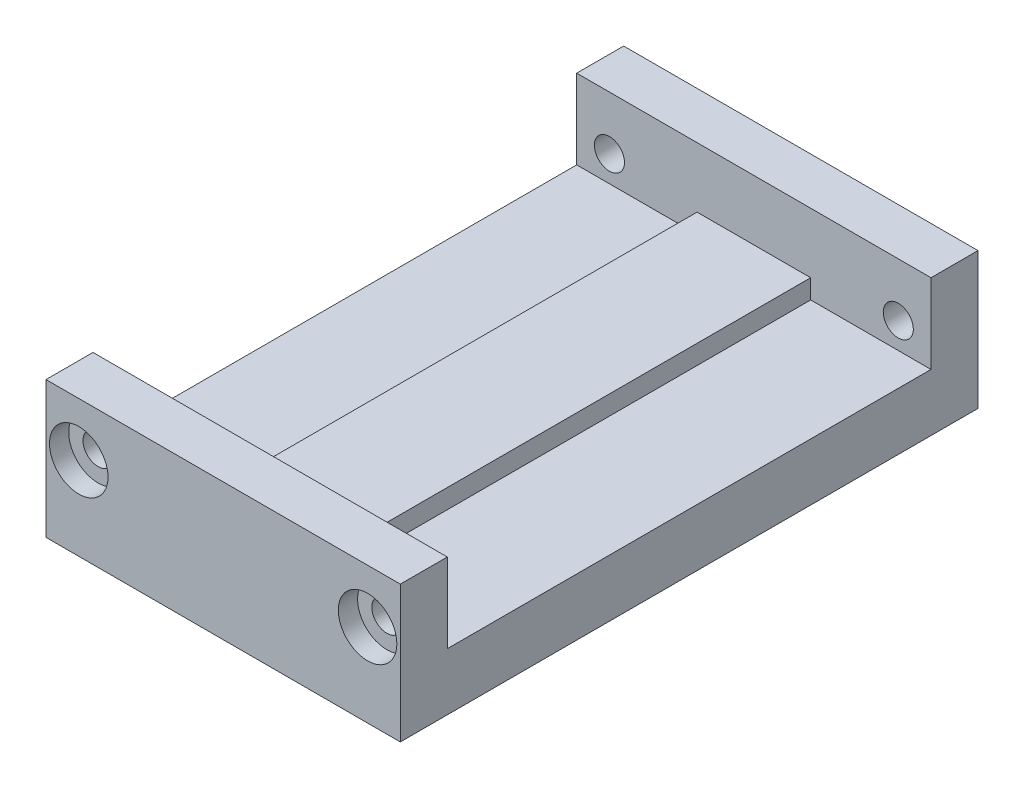
ISO-10303-21;
HEADER;
FILE_DESCRIPTION(('STEP AP214'),'2;1');
FILE_NAME('part.step','',(''),(''),'','','');
FILE_SCHEMA(('AUTOMOTIVE_DESIGN { 1 0 10303 214 1 1 1 1 }'));
ENDSEC;
DATA;
#1=APPLICATION_CONTEXT('core data for automotive mechanical design processes');
#2=APPLICATION_PROTOCOL_DEFINITION('international standard','automotive_design',2000,#1);
#3=PRODUCT_CONTEXT('',#1,'mechanical');
#4=PRODUCT('Part','Part','',(#3));
#5=PRODUCT_RELATED_PRODUCT_CATEGORY('part','',(#4));
#6=PRODUCT_DEFINITION_FORMATION('','',#4);
#7=PRODUCT_DEFINITION_CONTEXT('part definition',#1,'design');
#8=PRODUCT_DEFINITION('design','',#6,#7);
#9=PRODUCT_DEFINITION_SHAPE('','',#8);
#10=(LENGTH_UNIT() NAMED_UNIT(*) SI_UNIT(.MILLI.,.METRE.));
#11=(NAMED_UNIT(*) PLANE_ANGLE_UNIT() SI_UNIT($,.RADIAN.));
#12=(NAMED_UNIT(*) SI_UNIT($,.STERADIAN.) SOLID_ANGLE_UNIT());
#13=UNCERTAINTY_MEASURE_WITH_UNIT(LENGTH_MEASURE(1.E-05),#10,'distance_accuracy_value','');
#14=(GEOMETRIC_REPRESENTATION_CONTEXT(3) GLOBAL_UNCERTAINTY_ASSIGNED_CONTEXT((#13)) GLOBAL_UNIT_ASSIGNED_CONTEXT((#10,
#11,#12)) REPRESENTATION_CONTEXT('',''));
#15=CARTESIAN_POINT('',(0.,0.,0.));
#16=DIRECTION('',(0.,0.,1.));
#17=DIRECTION('',(1.,0.,0.));
#18=AXIS2_PLACEMENT_3D('',#15,#16,#17);
#19=CARTESIAN_POINT('',(9.525,5.4864,19.05));
#20=DIRECTION('',(0.,0.,-1.));
#21=DIRECTION('',(-1.,0.,0.));
#22=AXIS2_PLACEMENT_3D('',#19,#20,#21);
#23=CYLINDRICAL_SURFACE('',#22,0.992187499999999);
#24=CARTESIAN_POINT('',(9.525,5.4864,-15.9512));
#25=DIRECTION('',(0.,0.,-1.));
#26=DIRECTION('',(-1.,0.,0.));
#27=AXIS2_PLACEMENT_3D('',#24,#25,#26);
#28=CIRCLE('',#27,0.992187499999999);
#29=CARTESIAN_POINT('',(8.5328125,5.4864,-15.9512));
#30=VERTEX_POINT('',#29);
#31=EDGE_CURVE('E11',#30,#30,#28,.T.);
#32=CARTESIAN_POINT('',(9.525,5.4864,-17.78));
#33=DIRECTION('',(0.,0.,-1.));
#34=DIRECTION('',(-1.,0.,0.));
#35=AXIS2_PLACEMENT_3D('',#32,#33,#34);
#36=CIRCLE('',#35,0.992187499999999);
#37=CARTESIAN_POINT('',(8.5328125,5.4864,-17.78));
#38=VERTEX_POINT('',#37);
#39=EDGE_CURVE('E365',#38,#38,#36,.T.);
#40=CARTESIAN_POINT('',(8.5328125,5.4864,-15.9512));
#41=CARTESIAN_POINT('',(8.5328125,5.4864,-15.97025));
#42=CARTESIAN_POINT('',(8.5328125,5.4864,-15.9893));
#43=CARTESIAN_POINT('',(8.5328125,5.4864,-16.0274));
#44=CARTESIAN_POINT('',(8.5328125,5.4864,-16.04645));
#45=CARTESIAN_POINT('',(8.5328125,5.4864,-16.08455));
#46=CARTESIAN_POINT('',(8.5328125,5.4864,-16.1036));
#47=CARTESIAN_POINT('',(8.5328125,5.4864,-16.1417));
#48=CARTESIAN_POINT('',(8.5328125,5.4864,-16.16075));
#49=CARTESIAN_POINT('',(8.5328125,5.4864,-16.19885));
#50=CARTESIAN_POINT('',(8.5328125,5.4864,-16.2179));
#51=CARTESIAN_POINT('',(8.5328125,5.4864,-16.256));
#52=CARTESIAN_POINT('',(8.5328125,5.4864,-16.27505));
#53=CARTESIAN_POINT('',(8.5328125,5.4864,-16.31315));
#54=CARTESIAN_POINT('',(8.5328125,5.4864,-16.3322));
#55=CARTESIAN_POINT('',(8.5328125,5.4864,-16.3703));
#56=CARTESIAN_POINT('',(8.5328125,5.4864,-16.38935));
#57=CARTESIAN_POINT('',(8.5328125,5.4864,-16.42745));
#58=CARTESIAN_POINT('',(8.5328125,5.4864,-16.4465));
#59=CARTESIAN_POINT('',(8.5328125,5.4864,-16.4846));
#60=CARTESIAN_POINT('',(8.5328125,5.4864,-16.50365));
#61=CARTESIAN_POINT('',(8.5328125,5.4864,-16.54175));
#62=CARTESIAN_POINT('',(8.5328125,5.4864,-16.5608));
#63=CARTESIAN_POINT('',(8.5328125,5.4864,-16.5989));
#64=CARTESIAN_POINT('',(8.5328125,5.4864,-16.61795));
#65=CARTESIAN_POINT('',(8.5328125,5.4864,-16.65605));
#66=CARTESIAN_POINT('',(8.5328125,5.4864,-16.6751));
#67=CARTESIAN_POINT('',(8.5328125,5.4864,-16.7132));
#68=CARTESIAN_POINT('',(8.5328125,5.4864,-16.73225));
#69=CARTESIAN_POINT('',(8.5328125,5.4864,-16.77035));
#70=CARTESIAN_POINT('',(8.5328125,5.4864,-16.7894));
#71=CARTESIAN_POINT('',(8.5328125,5.4864,-16.8275));
#72=CARTESIAN_POINT('',(8.5328125,5.4864,-16.84655));
#73=CARTESIAN_POINT('',(8.5328125,5.4864,-16.88465));
#74=CARTESIAN_POINT('',(8.5328125,5.4864,-16.9037));
#75=CARTESIAN_POINT('',(8.5328125,5.4864,-16.9418));
#76=CARTESIAN_POINT('',(8.5328125,5.4864,-16.96085));
#77=CARTESIAN_POINT('',(8.5328125,5.4864,-16.99895));
#78=CARTESIAN_POINT('',(8.5328125,5.4864,-17.018));
#79=CARTESIAN_POINT('',(8.5328125,5.4864,-17.0561));
#80=CARTESIAN_POINT('',(8.5328125,5.4864,-17.07515));
#81=CARTESIAN_POINT('',(8.5328125,5.4864,-17.11325));
#82=CARTESIAN_POINT('',(8.5328125,5.4864,-17.1323));
#83=CARTESIAN_POINT('',(8.5328125,5.4864,-17.1704));
#84=CARTESIAN_POINT('',(8.5328125,5.4864,-17.18945));
#85=CARTESIAN_POINT('',(8.5328125,5.4864,-17.22755));
#86=CARTESIAN_POINT('',(8.5328125,5.4864,-17.2466));
#87=CARTESIAN_POINT('',(8.5328125,5.4864,-17.2847));
#88=CARTESIAN_POINT('',(8.5328125,5.4864,-17.30375));
#89=CARTESIAN_POINT('',(8.5328125,5.4864,-17.34185));
#90=CARTESIAN_POINT('',(8.5328125,5.4864,-17.3609));
#91=CARTESIAN_POINT('',(8.5328125,5.4864,-17.399));
#92=CARTESIAN_POINT('',(8.5328125,5.4864,-17.41805));
#93=CARTESIAN_POINT('',(8.5328125,5.4864,-17.45615));
#94=CARTESIAN_POINT('',(8.5328125,5.4864,-17.4752));
#95=CARTESIAN_POINT('',(8.5328125,5.4864,-17.5133));
#96=CARTESIAN_POINT('',(8.5328125,5.4864,-17.53235));
#97=CARTESIAN_POINT('',(8.5328125,5.4864,-17.57045));
#98=CARTESIAN_POINT('',(8.5328125,5.4864,-17.5895));
#99=CARTESIAN_POINT('',(8.5328125,5.4864,-17.6276));
#100=CARTESIAN_POINT('',(8.5328125,5.4864,-17.64665));
#101=CARTESIAN_POINT('',(8.5328125,5.4864,-17.68475));
#102=CARTESIAN_POINT('',(8.5328125,5.4864,-17.7038));
#103=CARTESIAN_POINT('',(8.5328125,5.4864,-17.7419));
#104=CARTESIAN_POINT('',(8.5328125,5.4864,-17.76095));
#105=CARTESIAN_POINT('',(8.5328125,5.4864,-17.78));
#106=B_SPLINE_CURVE_WITH_KNOTS('',3,(#40,#41,#42,#43,#44,#45,#46,#47,#48,#49,#50,#51,#52,#53,
#54,#55,#56,#57,#58,#59,#60,#61,#62,#63,#64,#65,#66,#67,#68,#69,#70,#71,#72,#73,#74,#75,#76,#77,
#78,#79,#80,#81,#82,#83,#84,#85,#86,#87,#88,#89,#90,#91,#92,#93,#94,#95,#96,#97,#98,#99,#100,
#101,#102,#103,#104,#105),.UNSPECIFIED.,.F.,.F.,(4,2,2,2,2,2,2,2,2,2,2,2,2,2,2,2,2,2,2,2,2,2,2,
2,2,2,2,2,2,2,2,2,4),(0.,0.0571499999999989,0.114299999999998,0.171449999999997,
0.228599999999995,0.285750000000001,0.3429,0.400049999999999,0.457199999999998,
0.514349999999997,0.571499999999996,0.628649999999994,0.6858,0.742949999999999,
0.800099999999998,0.857249999999997,0.914399999999996,0.971549999999995,1.02869999999999,
1.08584999999999,1.14299999999999,1.20015,1.2573,1.31444999999999,1.37159999999999,
1.42874999999999,1.48589999999999,1.54304999999999,1.6002,1.65734999999999,1.71449999999999,
1.77164999999999,1.82879999999999),.UNSPECIFIED.);
#107=EDGE_CURVE('BSEAM361',#30,#38,#106,.T.);
#108=ORIENTED_EDGE('',*,*,#31,.F.);
#109=ORIENTED_EDGE('',*,*,#39,.T.);
#110=ORIENTED_EDGE('',*,*,#107,.T.);
#111=ORIENTED_EDGE('',*,*,#107,.F.);
#112=EDGE_LOOP('',(#108,#110,#109,#111));
#113=FACE_BOUND('',#112,.T.);
#114=ADVANCED_FACE('F361',(#113),#23,.F.);
#115=CARTESIAN_POINT('',(-9.525,5.4864,19.05));
#116=DIRECTION('',(0.,0.,-1.));
#117=DIRECTION('',(-1.,0.,0.));
#118=AXIS2_PLACEMENT_3D('',#115,#116,#117);
#119=CYLINDRICAL_SURFACE('',#118,0.992187499999999);
#120=CARTESIAN_POINT('',(-9.525,5.4864,-15.9512));
#121=DIRECTION('',(0.,0.,-1.));
#122=DIRECTION('',(-1.,0.,0.));
#123=AXIS2_PLACEMENT_3D('',#120,#121,#122);
#124=CIRCLE('',#123,0.992187499999999);
#125=CARTESIAN_POINT('',(-10.5171875,5.4864,-15.9512));
#126=VERTEX_POINT('',#125);
#127=EDGE_CURVE('E497',#126,#126,#124,.T.);
#128=CARTESIAN_POINT('',(-9.525,5.4864,-17.78));
#129=DIRECTION('',(0.,0.,-1.));
#130=DIRECTION('',(-1.,0.,0.));
#131=AXIS2_PLACEMENT_3D('',#128,#129,#130);
#132=CIRCLE('',#131,0.992187499999999);
#133=CARTESIAN_POINT('',(-10.5171875,5.4864,-17.78));
#134=VERTEX_POINT('',#133);
#135=EDGE_CURVE('E540',#134,#134,#132,.T.);
#136=CARTESIAN_POINT('',(-10.5171875,5.4864,-15.9512));
#137=CARTESIAN_POINT('',(-10.5171875,5.4864,-15.97025));
#138=CARTESIAN_POINT('',(-10.5171875,5.4864,-15.9893));
#139=CARTESIAN_POINT('',(-10.5171875,5.4864,-16.0274));
#140=CARTESIAN_POINT('',(-10.5171875,5.4864,-16.04645));
#141=CARTESIAN_POINT('',(-10.5171875,5.4864,-16.08455));
#142=CARTESIAN_POINT('',(-10.5171875,5.4864,-16.1036));
#143=CARTESIAN_POINT('',(-10.5171875,5.4864,-16.1417));
#144=CARTESIAN_POINT('',(-10.5171875,5.4864,-16.16075));
#145=CARTESIAN_POINT('',(-10.5171875,5.4864,-16.19885));
#146=CARTESIAN_POINT('',(-10.5171875,5.4864,-16.2179));
#147=CARTESIAN_POINT('',(-10.5171875,5.4864,-16.256));
#148=CARTESIAN_POINT('',(-10.5171875,5.4864,-16.27505));
#149=CARTESIAN_POINT('',(-10.5171875,5.4864,-16.31315));
#150=CARTESIAN_POINT('',(-10.5171875,5.4864,-16.3322));
#151=CARTESIAN_POINT('',(-10.5171875,5.4864,-16.3703));
#152=CARTESIAN_POINT('',(-10.5171875,5.4864,-16.38935));
#153=CARTESIAN_POINT('',(-10.5171875,5.4864,-16.42745));
#154=CARTESIAN_POINT('',(-10.5171875,5.4864,-16.4465));
#155=CARTESIAN_POINT('',(-10.5171875,5.4864,-16.4846));
#156=CARTESIAN_POINT('',(-10.5171875,5.4864,-16.50365));
#157=CARTESIAN_POINT('',(-10.5171875,5.4864,-16.54175));
#158=CARTESIAN_POINT('',(-10.5171875,5.4864,-16.5608));
#159=CARTESIAN_POINT('',(-10.5171875,5.4864,-16.5989));
#160=CARTESIAN_POINT('',(-10.5171875,5.4864,-16.61795));
#161=CARTESIAN_POINT('',(-10.5171875,5.4864,-16.65605));
#162=CARTESIAN_POINT('',(-10.5171875,5.4864,-16.6751));
#163=CARTESIAN_POINT('',(-10.5171875,5.4864,-16.7132));
#164=CARTESIAN_POINT('',(-10.5171875,5.4864,-16.73225));
#165=CARTESIAN_POINT('',(-10.5171875,5.4864,-16.77035));
#166=CARTESIAN_POINT('',(-10.5171875,5.4864,-16.7894));
#167=CARTESIAN_POINT('',(-10.5171875,5.4864,-16.8275));
#168=CARTESIAN_POINT('',(-10.5171875,5.4864,-16.84655));
#169=CARTESIAN_POINT('',(-10.5171875,5.4864,-16.88465));
#170=CARTESIAN_POINT('',(-10.5171875,5.4864,-16.9037));
#171=CARTESIAN_POINT('',(-10.5171875,5.4864,-16.9418));
#172=CARTESIAN_POINT('',(-10.5171875,5.4864,-16.96085));
#173=CARTESIAN_POINT('',(-10.5171875,5.4864,-16.99895));
#174=CARTESIAN_POINT('',(-10.5171875,5.4864,-17.018));
#175=CARTESIAN_POINT('',(-10.5171875,5.4864,-17.0561));
#176=CARTESIAN_POINT('',(-10.5171875,5.4864,-17.07515));
#177=CARTESIAN_POINT('',(-10.5171875,5.4864,-17.11325));
#178=CARTESIAN_POINT('',(-10.5171875,5.4864,-17.1323));
#179=CARTESIAN_POINT('',(-10.5171875,5.4864,-17.1704));
#180=CARTESIAN_POINT('',(-10.5171875,5.4864,-17.18945));
#181=CARTESIAN_POINT('',(-10.5171875,5.4864,-17.22755));
#182=CARTESIAN_POINT('',(-10.5171875,5.4864,-17.2466));
#183=CARTESIAN_POINT('',(-10.5171875,5.4864,-17.2847));
#184=CARTESIAN_POINT('',(-10.5171875,5.4864,-17.30375));
#185=CARTESIAN_POINT('',(-10.5171875,5.4864,-17.34185));
#186=CARTESIAN_POINT('',(-10.5171875,5.4864,-17.3609));
#187=CARTESIAN_POINT('',(-10.5171875,5.4864,-17.399));
#188=CARTESIAN_POINT('',(-10.5171875,5.4864,-17.41805));
#189=CARTESIAN_POINT('',(-10.5171875,5.4864,-17.45615));
#190=CARTESIAN_POINT('',(-10.5171875,5.4864,-17.4752));
#191=CARTESIAN_POINT('',(-10.5171875,5.4864,-17.5133));
#192=CARTESIAN_POINT('',(-10.5171875,5.4864,-17.53235));
#193=CARTESIAN_POINT('',(-10.5171875,5.4864,-17.57045));
#194=CARTESIAN_POINT('',(-10.5171875,5.4864,-17.5895));
#195=CARTESIAN_POINT('',(-10.5171875,5.4864,-17.6276));
#196=CARTESIAN_POINT('',(-10.5171875,5.4864,-17.64665));
#197=CARTESIAN_POINT('',(-10.5171875,5.4864,-17.68475));
#198=CARTESIAN_POINT('',(-10.5171875,5.4864,-17.7038));
#199=CARTESIAN_POINT('',(-10.5171875,5.4864,-17.7419));
#200=CARTESIAN_POINT('',(-10.5171875,5.4864,-17.76095));
#201=CARTESIAN_POINT('',(-10.5171875,5.4864,-17.78));
#202=B_SPLINE_CURVE_WITH_KNOTS('',3,(#136,#137,#138,#139,#140,#141,#142,#143,#144,#145,#146,
#147,#148,#149,#150,#151,#152,#153,#154,#155,#156,#157,#158,#159,#160,#161,#162,#163,#164,#165,
#166,#167,#168,#169,#170,#171,#172,#173,#174,#175,#176,#177,#178,#179,#180,#181,#182,#183,#184,
#185,#186,#187,#188,#189,#190,#191,#192,#193,#194,#195,#196,#197,#198,#199,#200,#201),
.UNSPECIFIED.,.F.,.F.,(4,2,2,2,2,2,2,2,2,2,2,2,2,2,2,2,2,2,2,2,2,2,2,2,2,2,2,2,2,2,2,2,4),(0.,
0.0571499999999989,0.114299999999998,0.171449999999997,0.228599999999995,0.285750000000001,
0.3429,0.400049999999999,0.457199999999998,0.514349999999997,0.571499999999996,
0.628649999999994,0.6858,0.742949999999999,0.800099999999998,0.857249999999997,
0.914399999999996,0.971549999999995,1.02869999999999,1.08584999999999,1.14299999999999,1.20015,
1.2573,1.31444999999999,1.37159999999999,1.42874999999999,1.48589999999999,1.54304999999999,
1.6002,1.65734999999999,1.71449999999999,1.77164999999999,1.82879999999999),.UNSPECIFIED.);
#203=EDGE_CURVE('BSEAM626',#126,#134,#202,.T.);
#204=ORIENTED_EDGE('',*,*,#127,.F.);
#205=ORIENTED_EDGE('',*,*,#135,.T.);
#206=ORIENTED_EDGE('',*,*,#203,.T.);
#207=ORIENTED_EDGE('',*,*,#203,.F.);
#208=EDGE_LOOP('',(#204,#206,#205,#207));
#209=FACE_BOUND('',#208,.T.);
#210=ADVANCED_FACE('F626',(#209),#119,.F.);
#211=CARTESIAN_POINT('',(9.525,5.4864,15.9512));
#212=DIRECTION('',(0.,0.,1.));
#213=DIRECTION('',(1.,0.,0.));
#214=AXIS2_PLACEMENT_3D('',#211,#212,#213);
#215=CIRCLE('',#214,0.992187499999999);
#216=CARTESIAN_POINT('',(8.5328125,5.4864,15.9512));
#217=VERTEX_POINT('',#216);
#218=EDGE_CURVE('E370',#217,#217,#215,.T.);
#219=CARTESIAN_POINT('',(9.525,5.4864,17.78));
#220=DIRECTION('',(0.,0.,1.));
#221=DIRECTION('',(1.,0.,0.));
#222=AXIS2_PLACEMENT_3D('',#219,#220,#221);
#223=CIRCLE('',#222,0.992187499999999);
#224=CARTESIAN_POINT('',(8.5328125,5.4864,17.78));
#225=VERTEX_POINT('',#224);
#226=EDGE_CURVE('E536',#225,#225,#223,.T.);
#227=CARTESIAN_POINT('',(8.5328125,5.4864,15.9512));
#228=CARTESIAN_POINT('',(8.5328125,5.4864,15.97025));
#229=CARTESIAN_POINT('',(8.5328125,5.4864,15.9893));
#230=CARTESIAN_POINT('',(8.5328125,5.4864,16.0274));
#231=CARTESIAN_POINT('',(8.5328125,5.4864,16.04645));
#232=CARTESIAN_POINT('',(8.5328125,5.4864,16.08455));
#233=CARTESIAN_POINT('',(8.5328125,5.4864,16.1036));
#234=CARTESIAN_POINT('',(8.5328125,5.4864,16.1417));
#235=CARTESIAN_POINT('',(8.5328125,5.4864,16.16075));
#236=CARTESIAN_POINT('',(8.5328125,5.4864,16.19885));
#237=CARTESIAN_POINT('',(8.5328125,5.4864,16.2179));
#238=CARTESIAN_POINT('',(8.5328125,5.4864,16.256));
#239=CARTESIAN_POINT('',(8.5328125,5.4864,16.27505));
#240=CARTESIAN_POINT('',(8.5328125,5.4864,16.31315));
#241=CARTESIAN_POINT('',(8.5328125,5.4864,16.3322));
#242=CARTESIAN_POINT('',(8.5328125,5.4864,16.3703));
#243=CARTESIAN_POINT('',(8.5328125,5.4864,16.38935));
#244=CARTESIAN_POINT('',(8.5328125,5.4864,16.42745));
#245=CARTESIAN_POINT('',(8.5328125,5.4864,16.4465));
#246=CARTESIAN_POINT('',(8.5328125,5.4864,16.4846));
#247=CARTESIAN_POINT('',(8.5328125,5.4864,16.50365));
#248=CARTESIAN_POINT('',(8.5328125,5.4864,16.54175));
#249=CARTESIAN_POINT('',(8.5328125,5.4864,16.5608));
#250=CARTESIAN_POINT('',(8.5328125,5.4864,16.5989));
#251=CARTESIAN_POINT('',(8.5328125,5.4864,16.61795));
#252=CARTESIAN_POINT('',(8.5328125,5.4864,16.65605));
#253=CARTESIAN_POINT('',(8.5328125,5.4864,16.6751));
#254=CARTESIAN_POINT('',(8.5328125,5.4864,16.7132));
#255=CARTESIAN_POINT('',(8.5328125,5.4864,16.73225));
#256=CARTESIAN_POINT('',(8.5328125,5.4864,16.77035));
#257=CARTESIAN_POINT('',(8.5328125,5.4864,16.7894));
#258=CARTESIAN_POINT('',(8.5328125,5.4864,16.8275));
#259=CARTESIAN_POINT('',(8.5328125,5.4864,16.84655));
#260=CARTESIAN_POINT('',(8.5328125,5.4864,16.88465));
#261=CARTESIAN_POINT('',(8.5328125,5.4864,16.9037));
#262=CARTESIAN_POINT('',(8.5328125,5.4864,16.9418));
#263=CARTESIAN_POINT('',(8.5328125,5.4864,16.96085));
#264=CARTESIAN_POINT('',(8.5328125,5.4864,16.99895));
#265=CARTESIAN_POINT('',(8.5328125,5.4864,17.018));
#266=CARTESIAN_POINT('',(8.5328125,5.4864,17.0561));
#267=CARTESIAN_POINT('',(8.5328125,5.4864,17.07515));
#268=CARTESIAN_POINT('',(8.5328125,5.4864,17.11325));
#269=CARTESIAN_POINT('',(8.5328125,5.4864,17.1323));
#270=CARTESIAN_POINT('',(8.5328125,5.4864,17.1704));
#271=CARTESIAN_POINT('',(8.5328125,5.4864,17.18945));
#272=CARTESIAN_POINT('',(8.5328125,5.4864,17.22755));
#273=CARTESIAN_POINT('',(8.5328125,5.4864,17.2466));
#274=CARTESIAN_POINT('',(8.5328125,5.4864,17.2847));
#275=CARTESIAN_POINT('',(8.5328125,5.4864,17.30375));
#276=CARTESIAN_POINT('',(8.5328125,5.4864,17.34185));
#277=CARTESIAN_POINT('',(8.5328125,5.4864,17.3609));
#278=CARTESIAN_POINT('',(8.5328125,5.4864,17.399));
#279=CARTESIAN_POINT('',(8.5328125,5.4864,17.41805));
#280=CARTESIAN_POINT('',(8.5328125,5.4864,17.45615));
#281=CARTESIAN_POINT('',(8.5328125,5.4864,17.4752));
#282=CARTESIAN_POINT('',(8.5328125,5.4864,17.5133));
#283=CARTESIAN_POINT('',(8.5328125,5.4864,17.53235));
#284=CARTESIAN_POINT('',(8.5328125,5.4864,17.57045));
#285=CARTESIAN_POINT('',(8.5328125,5.4864,17.5895));
#286=CARTESIAN_POINT('',(8.5328125,5.4864,17.6276));
#287=CARTESIAN_POINT('',(8.5328125,5.4864,17.64665));
#288=CARTESIAN_POINT('',(8.5328125,5.4864,17.68475));
#289=CARTESIAN_POINT('',(8.5328125,5.4864,17.7038));
#290=CARTESIAN_POINT('',(8.5328125,5.4864,17.7419));
#291=CARTESIAN_POINT('',(8.5328125,5.4864,17.76095));
#292=CARTESIAN_POINT('',(8.5328125,5.4864,17.78));
#293=B_SPLINE_CURVE_WITH_KNOTS('',3,(#227,#228,#229,#230,#231,#232,#233,#234,#235,#236,#237,
#238,#239,#240,#241,#242,#243,#244,#245,#246,#247,#248,#249,#250,#251,#252,#253,#254,#255,#256,
#257,#258,#259,#260,#261,#262,#263,#264,#265,#266,#267,#268,#269,#270,#271,#272,#273,#274,#275,
#276,#277,#278,#279,#280,#281,#282,#283,#284,#285,#286,#287,#288,#289,#290,#291,#292),
.UNSPECIFIED.,.F.,.F.,(4,2,2,2,2,2,2,2,2,2,2,2,2,2,2,2,2,2,2,2,2,2,2,2,2,2,2,2,2,2,2,2,4),(0.,
0.0571500000000023,0.114300000000001,0.17145,0.228600000000002,0.285750000000001,
0.342900000000004,0.400050000000002,0.457200000000001,0.51435,0.571500000000003,
0.628650000000001,0.685800000000004,0.742950000000003,0.800100000000001,0.857250000000004,
0.914400000000003,0.971550000000002,1.0287,1.08585,1.143,1.20015,1.2573,1.31445,1.3716,1.42875,
1.4859,1.54305,1.6002,1.65735000000001,1.7145,1.77165,1.82880000000001),.UNSPECIFIED.);
#294=EDGE_CURVE('BSEAM629',#217,#225,#293,.T.);
#295=ORIENTED_EDGE('',*,*,#218,.F.);
#296=ORIENTED_EDGE('',*,*,#226,.T.);
#297=ORIENTED_EDGE('',*,*,#294,.T.);
#298=ORIENTED_EDGE('',*,*,#294,.F.);
#299=EDGE_LOOP('',(#295,#297,#296,#298));
#300=FACE_BOUND('',#299,.T.);
#301=ADVANCED_FACE('F629',(#300),#23,.F.);
#302=CARTESIAN_POINT('',(-9.525,5.4864,15.9512));
#303=DIRECTION('',(0.,0.,1.));
#304=DIRECTION('',(1.,0.,0.));
#305=AXIS2_PLACEMENT_3D('',#302,#303,#304);
#306=CIRCLE('',#305,0.992187499999999);
#307=CARTESIAN_POINT('',(-10.5171875,5.4864,15.9512));
#308=VERTEX_POINT('',#307);
#309=EDGE_CURVE('E490',#308,#308,#306,.T.);
#310=CARTESIAN_POINT('',(-9.525,5.4864,17.78));
#311=DIRECTION('',(0.,0.,1.));
#312=DIRECTION('',(1.,0.,0.));
#313=AXIS2_PLACEMENT_3D('',#310,#311,#312);
#314=CIRCLE('',#313,0.992187499999999);
#315=CARTESIAN_POINT('',(-10.5171875,5.4864,17.78));
#316=VERTEX_POINT('',#315);
#317=EDGE_CURVE('E474',#316,#316,#314,.T.);
#318=CARTESIAN_POINT('',(-10.5171875,5.4864,15.9512));
#319=CARTESIAN_POINT('',(-10.5171875,5.4864,15.97025));
#320=CARTESIAN_POINT('',(-10.5171875,5.4864,15.9893));
#321=CARTESIAN_POINT('',(-10.5171875,5.4864,16.0274));
#322=CARTESIAN_POINT('',(-10.5171875,5.4864,16.04645));
#323=CARTESIAN_POINT('',(-10.5171875,5.4864,16.08455));
#324=CARTESIAN_POINT('',(-10.5171875,5.4864,16.1036));
#325=CARTESIAN_POINT('',(-10.5171875,5.4864,16.1417));
#326=CARTESIAN_POINT('',(-10.5171875,5.4864,16.16075));
#327=CARTESIAN_POINT('',(-10.5171875,5.4864,16.19885));
#328=CARTESIAN_POINT('',(-10.5171875,5.4864,16.2179));
#329=CARTESIAN_POINT('',(-10.5171875,5.4864,16.256));
#330=CARTESIAN_POINT('',(-10.5171875,5.4864,16.27505));
#331=CARTESIAN_POINT('',(-10.5171875,5.4864,16.31315));
#332=CARTESIAN_POINT('',(-10.5171875,5.4864,16.3322));
#333=CARTESIAN_POINT('',(-10.5171875,5.4864,16.3703));
#334=CARTESIAN_POINT('',(-10.5171875,5.4864,16.38935));
#335=CARTESIAN_POINT('',(-10.5171875,5.4864,16.42745));
#336=CARTESIAN_POINT('',(-10.5171875,5.4864,16.4465));
#337=CARTESIAN_POINT('',(-10.5171875,5.4864,16.4846));
#338=CARTESIAN_POINT('',(-10.5171875,5.4864,16.50365));
#339=CARTESIAN_POINT('',(-10.5171875,5.4864,16.54175));
#340=CARTESIAN_POINT('',(-10.5171875,5.4864,16.5608));
#341=CARTESIAN_POINT('',(-10.5171875,5.4864,16.5989));
#342=CARTESIAN_POINT('',(-10.5171875,5.4864,16.61795));
#343=CARTESIAN_POINT('',(-10.5171875,5.4864,16.65605));
#344=CARTESIAN_POINT('',(-10.5171875,5.4864,16.6751));
#345=CARTESIAN_POINT('',(-10.5171875,5.4864,16.7132));
#346=CARTESIAN_POINT('',(-10.5171875,5.4864,16.73225));
#347=CARTESIAN_POINT('',(-10.5171875,5.4864,16.77035));
#348=CARTESIAN_POINT('',(-10.5171875,5.4864,16.7894));
#349=CARTESIAN_POINT('',(-10.5171875,5.4864,16.8275));
#350=CARTESIAN_POINT('',(-10.5171875,5.4864,16.84655));
#351=CARTESIAN_POINT('',(-10.5171875,5.4864,16.88465));
#352=CARTESIAN_POINT('',(-10.5171875,5.4864,16.9037));
#353=CARTESIAN_POINT('',(-10.5171875,5.4864,16.9418));
#354=CARTESIAN_POINT('',(-10.5171875,5.4864,16.96085));
#355=CARTESIAN_POINT('',(-10.5171875,5.4864,16.99895));
#356=CARTESIAN_POINT('',(-10.5171875,5.4864,17.018));
#357=CARTESIAN_POINT('',(-10.5171875,5.4864,17.0561));
#358=CARTESIAN_POINT('',(-10.5171875,5.4864,17.07515));
#359=CARTESIAN_POINT('',(-10.5171875,5.4864,17.11325));
#360=CARTESIAN_POINT('',(-10.5171875,5.4864,17.1323));
#361=CARTESIAN_POINT('',(-10.5171875,5.4864,17.1704));
#362=CARTESIAN_POINT('',(-10.5171875,5.4864,17.18945));
#363=CARTESIAN_POINT('',(-10.5171875,5.4864,17.22755));
#364=CARTESIAN_POINT('',(-10.5171875,5.4864,17.2466));
#365=CARTESIAN_POINT('',(-10.5171875,5.4864,17.2847));
#366=CARTESIAN_POINT('',(-10.5171875,5.4864,17.30375));
#367=CARTESIAN_POINT('',(-10.5171875,5.4864,17.34185));
#368=CARTESIAN_POINT('',(-10.5171875,5.4864,17.3609));
#369=CARTESIAN_POINT('',(-10.5171875,5.4864,17.399));
#370=CARTESIAN_POINT('',(-10.5171875,5.4864,17.41805));
#371=CARTESIAN_POINT('',(-10.5171875,5.4864,17.45615));
#372=CARTESIAN_POINT('',(-10.5171875,5.4864,17.4752));
#373=CARTESIAN_POINT('',(-10.5171875,5.4864,17.5133));
#374=CARTESIAN_POINT('',(-10.5171875,5.4864,17.53235));
#375=CARTESIAN_POINT('',(-10.5171875,5.4864,17.57045));
#376=CARTESIAN_POINT('',(-10.5171875,5.4864,17.5895));
#377=CARTESIAN_POINT('',(-10.5171875,5.4864,17.6276));
#378=CARTESIAN_POINT('',(-10.5171875,5.4864,17.64665));
#379=CARTESIAN_POINT('',(-10.5171875,5.4864,17.68475));
#380=CARTESIAN_POINT('',(-10.5171875,5.4864,17.7038));
#381=CARTESIAN_POINT('',(-10.5171875,5.4864,17.7419));
#382=CARTESIAN_POINT('',(-10.5171875,5.4864,17.76095));
#383=CARTESIAN_POINT('',(-10.5171875,5.4864,17.78));
#384=B_SPLINE_CURVE_WITH_KNOTS('',3,(#318,#319,#320,#321,#322,#323,#324,#325,#326,#327,#328,
#329,#330,#331,#332,#333,#334,#335,#336,#337,#338,#339,#340,#341,#342,#343,#344,#345,#346,#347,
#348,#349,#350,#351,#352,#353,#354,#355,#356,#357,#358,#359,#360,#361,#362,#363,#364,#365,#366,
#367,#368,#369,#370,#371,#372,#373,#374,#375,#376,#377,#378,#379,#380,#381,#382,#383),
.UNSPECIFIED.,.F.,.F.,(4,2,2,2,2,2,2,2,2,2,2,2,2,2,2,2,2,2,2,2,2,2,2,2,2,2,2,2,2,2,2,2,4),(0.,
0.0571499999999989,0.114299999999998,0.17145,0.228599999999999,0.285749999999998,
0.342899999999997,0.400049999999999,0.457199999999998,0.514349999999997,0.571499999999999,
0.628649999999998,0.685799999999997,0.742949999999999,0.800099999999998,0.857249999999997,
0.914399999999999,0.971549999999998,1.0287,1.08585,1.143,1.20015,1.2573,1.31445,1.3716,1.42875,
1.4859,1.54305,1.6002,1.65735,1.7145,1.77165,1.8288),.UNSPECIFIED.);
#385=EDGE_CURVE('BSEAM619',#308,#316,#384,.T.);
#386=ORIENTED_EDGE('',*,*,#309,.F.);
#387=ORIENTED_EDGE('',*,*,#317,.T.);
#388=ORIENTED_EDGE('',*,*,#385,.T.);
#389=ORIENTED_EDGE('',*,*,#385,.F.);
#390=EDGE_LOOP('',(#386,#388,#387,#389));
#391=FACE_BOUND('',#390,.T.);
#392=ADVANCED_FACE('F619',(#391),#119,.F.);
#393=CARTESIAN_POINT('',(-11.684,9.017,19.05));
#394=DIRECTION('',(0.,-1.,0.));
#395=DIRECTION('',(1.,0.,0.));
#396=AXIS2_PLACEMENT_3D('',#393,#394,#395);
#397=PLANE('',#396);
#398=DIRECTION('',(0.,0.,-1.));
#399=VECTOR('',#398,1.);
#400=CARTESIAN_POINT('',(-11.684,9.017,19.05));
#401=LINE('',#400,#399);
#402=CARTESIAN_POINT('',(-11.684,9.017,-15.9512));
#403=VERTEX_POINT('',#402);
#404=CARTESIAN_POINT('',(-11.684,9.017,-19.05));
#405=VERTEX_POINT('',#404);
#406=EDGE_CURVE('E519',#403,#405,#401,.T.);
#407=ORIENTED_EDGE('',*,*,#406,.F.);
#408=DIRECTION('',(-1.,0.,0.));
#409=VECTOR('',#408,1.);
#410=CARTESIAN_POINT('',(-11.684,9.017,-15.9512));
#411=LINE('',#410,#409);
#412=CARTESIAN_POINT('',(11.684,9.017,-15.9512));
#413=VERTEX_POINT('',#412);
#414=EDGE_CURVE('E483',#413,#403,#411,.T.);
#415=ORIENTED_EDGE('',*,*,#414,.F.);
#416=DIRECTION('',(0.,0.,-1.));
#417=VECTOR('',#416,1.);
#418=CARTESIAN_POINT('',(11.684,9.017,19.05));
#419=LINE('',#418,#417);
#420=CARTESIAN_POINT('',(11.684,9.017,-19.05));
#421=VERTEX_POINT('',#420);
#422=EDGE_CURVE('E523',#413,#421,#419,.T.);
#423=ORIENTED_EDGE('',*,*,#422,.T.);
#424=DIRECTION('',(-1.,0.,0.));
#425=VECTOR('',#424,1.);
#426=CARTESIAN_POINT('',(-11.684,9.017,-19.05));
#427=LINE('',#426,#425);
#428=EDGE_CURVE('E509',#421,#405,#427,.T.);
#429=ORIENTED_EDGE('',*,*,#428,.T.);
#430=EDGE_LOOP('',(#407,#415,#423,#429));
#431=FACE_BOUND('',#430,.T.);
#432=ADVANCED_FACE('F597',(#431),#397,.F.);
#433=CARTESIAN_POINT('',(-11.684,9.017,19.05));
#434=DIRECTION('',(0.,0.,-1.));
#435=DIRECTION('',(-1.,0.,0.));
#436=AXIS2_PLACEMENT_3D('',#433,#434,#435);
#437=PLANE('',#436);
#438=CARTESIAN_POINT('',(9.525,5.4864,19.05));
#439=DIRECTION('',(0.,0.,1.));
#440=DIRECTION('',(1.,0.,0.));
#441=AXIS2_PLACEMENT_3D('',#438,#439,#440);
#442=CIRCLE('',#441,1.9304);
#443=CARTESIAN_POINT('',(11.4554,5.4864,19.05));
#444=VERTEX_POINT('',#443);
#445=EDGE_CURVE('E542',#444,#444,#442,.T.);
#446=ORIENTED_EDGE('',*,*,#445,.F.);
#447=EDGE_LOOP('',(#446));
#448=FACE_BOUND('',#447,.T.);
#449=CARTESIAN_POINT('',(-9.525,5.4864,19.05));
#450=DIRECTION('',(0.,0.,1.));
#451=DIRECTION('',(1.,0.,0.));
#452=AXIS2_PLACEMENT_3D('',#449,#450,#451);
#453=CIRCLE('',#452,1.9304);
#454=CARTESIAN_POINT('',(-7.5946,5.4864,19.05));
#455=VERTEX_POINT('',#454);
#456=EDGE_CURVE('E538',#455,#455,#453,.T.);
#457=ORIENTED_EDGE('',*,*,#456,.F.);
#458=EDGE_LOOP('',(#457));
#459=FACE_BOUND('',#458,.T.);
#460=DIRECTION('',(0.,-1.,0.));
#461=VECTOR('',#460,1.);
#462=CARTESIAN_POINT('',(-11.684,0.,19.05));
#463=LINE('',#462,#461);
#464=CARTESIAN_POINT('',(-11.684,9.017,19.05));
#465=VERTEX_POINT('',#464);
#466=CARTESIAN_POINT('',(-11.684,0.,19.05));
#467=VERTEX_POINT('',#466);
#468=EDGE_CURVE('E512',#465,#467,#463,.T.);
#469=ORIENTED_EDGE('',*,*,#468,.T.);
#470=DIRECTION('',(1.,0.,0.));
#471=VECTOR('',#470,1.);
#472=CARTESIAN_POINT('',(-11.684,0.,19.05));
#473=LINE('',#472,#471);
#474=CARTESIAN_POINT('',(11.684,0.,19.05));
#475=VERTEX_POINT('',#474);
#476=EDGE_CURVE('E514',#467,#475,#473,.T.);
#477=ORIENTED_EDGE('',*,*,#476,.T.);
#478=DIRECTION('',(0.,1.,0.));
#479=VECTOR('',#478,1.);
#480=CARTESIAN_POINT('',(11.684,9.017,19.05));
#481=LINE('',#480,#479);
#482=CARTESIAN_POINT('',(11.684,9.017,19.05));
#483=VERTEX_POINT('',#482);
#484=EDGE_CURVE('E516',#475,#483,#481,.T.);
#485=ORIENTED_EDGE('',*,*,#484,.T.);
#486=DIRECTION('',(-1.,0.,0.));
#487=VECTOR('',#486,1.);
#488=CARTESIAN_POINT('',(-11.684,9.017,19.05));
#489=LINE('',#488,#487);
#490=EDGE_CURVE('E386',#483,#465,#489,.T.);
#491=ORIENTED_EDGE('',*,*,#490,.T.);
#492=EDGE_LOOP('',(#469,#477,#485,#491));
#493=FACE_BOUND('',#492,.T.);
#494=ADVANCED_FACE('F609',(#448,#459,#493),#437,.F.);
#495=CARTESIAN_POINT('',(-11.684,0.,19.05));
#496=DIRECTION('',(1.,0.,0.));
#497=DIRECTION('',(0.,1.,0.));
#498=AXIS2_PLACEMENT_3D('',#495,#496,#497);
#499=PLANE('',#498);
#500=DIRECTION('',(0.,0.,1.));
#501=VECTOR('',#500,1.);
#502=CARTESIAN_POINT('',(-11.684,3.77825,-15.9512));
#503=LINE('',#502,#501);
#504=CARTESIAN_POINT('',(-11.684,3.77825,-15.9512));
#505=VERTEX_POINT('',#504);
#506=CARTESIAN_POINT('',(-11.684,3.77825,15.9512));
#507=VERTEX_POINT('',#506);
#508=EDGE_CURVE('E574',#505,#507,#503,.T.);
#509=ORIENTED_EDGE('',*,*,#508,.F.);
#510=DIRECTION('',(0.,1.,0.));
#511=VECTOR('',#510,1.);
#512=CARTESIAN_POINT('',(-11.684,5.04825,-15.9512));
#513=LINE('',#512,#511);
#514=EDGE_CURVE('E487',#505,#403,#513,.T.);
#515=ORIENTED_EDGE('',*,*,#514,.T.);
#516=ORIENTED_EDGE('',*,*,#406,.T.);
#517=DIRECTION('',(0.,-1.,0.));
#518=VECTOR('',#517,1.);
#519=CARTESIAN_POINT('',(-11.684,0.,-19.05));
#520=LINE('',#519,#518);
#521=CARTESIAN_POINT('',(-11.684,0.,-19.05));
#522=VERTEX_POINT('',#521);
#523=EDGE_CURVE('E500',#405,#522,#520,.T.);
#524=ORIENTED_EDGE('',*,*,#523,.T.);
#525=DIRECTION('',(0.,0.,-1.));
#526=VECTOR('',#525,1.);
#527=CARTESIAN_POINT('',(-11.684,0.,19.05));
#528=LINE('',#527,#526);
#529=EDGE_CURVE('E529',#467,#522,#528,.T.);
#530=ORIENTED_EDGE('',*,*,#529,.F.);
#531=ORIENTED_EDGE('',*,*,#468,.F.);
#532=CARTESIAN_POINT('',(-11.684,9.017,15.9512));
#533=VERTEX_POINT('',#532);
#534=EDGE_CURVE('E520',#465,#533,#401,.T.);
#535=ORIENTED_EDGE('',*,*,#534,.T.);
#536=DIRECTION('',(0.,1.,0.));
#537=VECTOR('',#536,1.);
#538=CARTESIAN_POINT('',(-11.684,5.04825,15.9512));
#539=LINE('',#538,#537);
#540=EDGE_CURVE('E378',#507,#533,#539,.T.);
#541=ORIENTED_EDGE('',*,*,#540,.F.);
#542=EDGE_LOOP('',(#509,#515,#516,#524,#530,#531,#535,#541));
#543=FACE_BOUND('',#542,.T.);
#544=ADVANCED_FACE('F363',(#543),#499,.F.);
#545=CARTESIAN_POINT('',(-11.684,0.,19.05));
#546=DIRECTION('',(0.,1.,0.));
#547=DIRECTION('',(-1.,0.,0.));
#548=AXIS2_PLACEMENT_3D('',#545,#546,#547);
#549=PLANE('',#548);
#550=ORIENTED_EDGE('',*,*,#529,.T.);
#551=DIRECTION('',(1.,0.,0.));
#552=VECTOR('',#551,1.);
#553=CARTESIAN_POINT('',(-11.684,0.,-19.05));
#554=LINE('',#553,#552);
#555=CARTESIAN_POINT('',(11.684,0.,-19.05));
#556=VERTEX_POINT('',#555);
#557=EDGE_CURVE('E503',#522,#556,#554,.T.);
#558=ORIENTED_EDGE('',*,*,#557,.T.);
#559=DIRECTION('',(0.,0.,-1.));
#560=VECTOR('',#559,1.);
#561=CARTESIAN_POINT('',(11.684,0.,19.05));
#562=LINE('',#561,#560);
#563=EDGE_CURVE('E527',#475,#556,#562,.T.);
#564=ORIENTED_EDGE('',*,*,#563,.F.);
#565=ORIENTED_EDGE('',*,*,#476,.F.);
#566=EDGE_LOOP('',(#550,#558,#564,#565));
#567=FACE_BOUND('',#566,.T.);
#568=ADVANCED_FACE('F606',(#567),#549,.F.);
#569=CARTESIAN_POINT('',(11.684,9.017,19.05));
#570=DIRECTION('',(-1.,0.,0.));
#571=DIRECTION('',(0.,-1.,0.));
#572=AXIS2_PLACEMENT_3D('',#569,#570,#571);
#573=PLANE('',#572);
#574=DIRECTION('',(0.,0.,-1.));
#575=VECTOR('',#574,1.);
#576=CARTESIAN_POINT('',(11.684,3.77825,15.9512));
#577=LINE('',#576,#575);
#578=CARTESIAN_POINT('',(11.684,3.77825,15.9512));
#579=VERTEX_POINT('',#578);
#580=CARTESIAN_POINT('',(11.684,3.77825,-15.9512));
#581=VERTEX_POINT('',#580);
#582=EDGE_CURVE('E565',#579,#581,#577,.T.);
#583=ORIENTED_EDGE('',*,*,#582,.F.);
#584=DIRECTION('',(0.,1.,0.));
#585=VECTOR('',#584,1.);
#586=CARTESIAN_POINT('',(11.684,5.04825,15.9512));
#587=LINE('',#586,#585);
#588=CARTESIAN_POINT('',(11.684,9.017,15.9512));
#589=VERTEX_POINT('',#588);
#590=EDGE_CURVE('E481',#579,#589,#587,.T.);
#591=ORIENTED_EDGE('',*,*,#590,.T.);
#592=EDGE_CURVE('E524',#483,#589,#419,.T.);
#593=ORIENTED_EDGE('',*,*,#592,.F.);
#594=ORIENTED_EDGE('',*,*,#484,.F.);
#595=ORIENTED_EDGE('',*,*,#563,.T.);
#596=DIRECTION('',(0.,1.,0.));
#597=VECTOR('',#596,1.);
#598=CARTESIAN_POINT('',(11.684,9.017,-19.05));
#599=LINE('',#598,#597);
#600=EDGE_CURVE('E506',#556,#421,#599,.T.);
#601=ORIENTED_EDGE('',*,*,#600,.T.);
#602=ORIENTED_EDGE('',*,*,#422,.F.);
#603=DIRECTION('',(0.,1.,0.));
#604=VECTOR('',#603,1.);
#605=CARTESIAN_POINT('',(11.684,5.04825,-15.9512));
#606=LINE('',#605,#604);
#607=EDGE_CURVE('E491',#581,#413,#606,.T.);
#608=ORIENTED_EDGE('',*,*,#607,.F.);
#609=EDGE_LOOP('',(#583,#591,#593,#594,#595,#601,#602,#608));
#610=FACE_BOUND('',#609,.T.);
#611=ADVANCED_FACE('F696',(#610),#573,.F.);
#612=ORIENTED_EDGE('',*,*,#592,.T.);
#613=DIRECTION('',(1.,0.,0.));
#614=VECTOR('',#613,1.);
#615=CARTESIAN_POINT('',(-11.684,9.017,15.9512));
#616=LINE('',#615,#614);
#617=EDGE_CURVE('E588',#533,#589,#616,.T.);
#618=ORIENTED_EDGE('',*,*,#617,.F.);
#619=ORIENTED_EDGE('',*,*,#534,.F.);
#620=ORIENTED_EDGE('',*,*,#490,.F.);
#621=EDGE_LOOP('',(#612,#618,#619,#620));
#622=FACE_BOUND('',#621,.T.);
#623=ADVANCED_FACE('F621',(#622),#397,.F.);
#624=CARTESIAN_POINT('',(-11.684,9.017,-19.05));
#625=DIRECTION('',(0.,0.,-1.));
#626=DIRECTION('',(-1.,0.,0.));
#627=AXIS2_PLACEMENT_3D('',#624,#625,#626);
#628=PLANE('',#627);
#629=CARTESIAN_POINT('',(9.525,5.4864,-19.05));
#630=DIRECTION('',(0.,0.,-1.));
#631=DIRECTION('',(-1.,0.,0.));
#632=AXIS2_PLACEMENT_3D('',#629,#630,#631);
#633=CIRCLE('',#632,1.9304);
#634=CARTESIAN_POINT('',(7.5946,5.4864,-19.05));
#635=VERTEX_POINT('',#634);
#636=EDGE_CURVE('E701',#635,#635,#633,.T.);
#637=ORIENTED_EDGE('',*,*,#636,.F.);
#638=EDGE_LOOP('',(#637));
#639=FACE_BOUND('',#638,.T.);
#640=CARTESIAN_POINT('',(-9.525,5.4864,-19.05));
#641=DIRECTION('',(0.,0.,-1.));
#642=DIRECTION('',(-1.,0.,0.));
#643=AXIS2_PLACEMENT_3D('',#640,#641,#642);
#644=CIRCLE('',#643,1.9304);
#645=CARTESIAN_POINT('',(-11.4554,5.4864,-19.05));
#646=VERTEX_POINT('',#645);
#647=EDGE_CURVE('E549',#646,#646,#644,.T.);
#648=ORIENTED_EDGE('',*,*,#647,.F.);
#649=EDGE_LOOP('',(#648));
#650=FACE_BOUND('',#649,.T.);
#651=ORIENTED_EDGE('',*,*,#523,.F.);
#652=ORIENTED_EDGE('',*,*,#428,.F.);
#653=ORIENTED_EDGE('',*,*,#600,.F.);
#654=ORIENTED_EDGE('',*,*,#557,.F.);
#655=EDGE_LOOP('',(#651,#652,#653,#654));
#656=FACE_BOUND('',#655,.T.);
#657=ADVANCED_FACE('F601',(#639,#650,#656),#628,.T.);
#658=CARTESIAN_POINT('',(-11.684,5.04825,-15.9512));
#659=DIRECTION('',(0.,1.,0.));
#660=DIRECTION('',(-1.,0.,0.));
#661=AXIS2_PLACEMENT_3D('',#658,#659,#660);
#662=PLANE('',#661);
#663=DIRECTION('',(0.,0.,1.));
#664=VECTOR('',#663,1.);
#665=CARTESIAN_POINT('',(3.7465,5.04825,-15.9512));
#666=LINE('',#665,#664);
#667=CARTESIAN_POINT('',(3.7465,5.04825,-15.9512));
#668=VERTEX_POINT('',#667);
#669=CARTESIAN_POINT('',(3.7465,5.04825,15.9512));
#670=VERTEX_POINT('',#669);
#671=EDGE_CURVE('E456',#668,#670,#666,.T.);
#672=ORIENTED_EDGE('',*,*,#671,.F.);
#673=DIRECTION('',(-1.,0.,0.));
#674=VECTOR('',#673,1.);
#675=CARTESIAN_POINT('',(-11.684,5.04825,-15.9512));
#676=LINE('',#675,#674);
#677=CARTESIAN_POINT('',(-3.7465,5.04825,-15.9512));
#678=VERTEX_POINT('',#677);
#679=EDGE_CURVE('E469',#668,#678,#676,.T.);
#680=ORIENTED_EDGE('',*,*,#679,.T.);
#681=DIRECTION('',(0.,0.,-1.));
#682=VECTOR('',#681,1.);
#683=CARTESIAN_POINT('',(-3.7465,5.04825,-15.9512));
#684=LINE('',#683,#682);
#685=CARTESIAN_POINT('',(-3.7465,5.04825,15.9512));
#686=VERTEX_POINT('',#685);
#687=EDGE_CURVE('E571',#686,#678,#684,.T.);
#688=ORIENTED_EDGE('',*,*,#687,.F.);
#689=DIRECTION('',(1.,0.,0.));
#690=VECTOR('',#689,1.);
#691=CARTESIAN_POINT('',(-11.684,5.04825,15.9512));
#692=LINE('',#691,#690);
#693=EDGE_CURVE('E472',#686,#670,#692,.T.);
#694=ORIENTED_EDGE('',*,*,#693,.T.);
#695=EDGE_LOOP('',(#672,#680,#688,#694));
#696=FACE_BOUND('',#695,.T.);
#697=ADVANCED_FACE('F467',(#696),#662,.T.);
#698=CARTESIAN_POINT('',(-11.684,5.04825,-15.9512));
#699=DIRECTION('',(0.,0.,-1.));
#700=DIRECTION('',(-1.,0.,0.));
#701=AXIS2_PLACEMENT_3D('',#698,#699,#700);
#702=PLANE('',#701);
#703=ORIENTED_EDGE('',*,*,#31,.T.);
#704=EDGE_LOOP('',(#703));
#705=FACE_BOUND('',#704,.T.);
#706=ORIENTED_EDGE('',*,*,#127,.T.);
#707=EDGE_LOOP('',(#706));
#708=FACE_BOUND('',#707,.T.);
#709=DIRECTION('',(0.,1.,0.));
#710=VECTOR('',#709,1.);
#711=CARTESIAN_POINT('',(-3.7465,3.77825,-15.9512));
#712=LINE('',#711,#710);
#713=CARTESIAN_POINT('',(-3.7465,3.77825,-15.9512));
#714=VERTEX_POINT('',#713);
#715=EDGE_CURVE('E478',#714,#678,#712,.T.);
#716=ORIENTED_EDGE('',*,*,#715,.T.);
#717=ORIENTED_EDGE('',*,*,#679,.F.);
#718=DIRECTION('',(0.,1.,0.));
#719=VECTOR('',#718,1.);
#720=CARTESIAN_POINT('',(3.7465,3.77825,-15.9512));
#721=LINE('',#720,#719);
#722=CARTESIAN_POINT('',(3.7465,3.77825,-15.9512));
#723=VERTEX_POINT('',#722);
#724=EDGE_CURVE('E453',#723,#668,#721,.T.);
#725=ORIENTED_EDGE('',*,*,#724,.F.);
#726=DIRECTION('',(-1.,0.,0.));
#727=VECTOR('',#726,1.);
#728=CARTESIAN_POINT('',(11.684,3.77825,-15.9512));
#729=LINE('',#728,#727);
#730=EDGE_CURVE('E568',#581,#723,#729,.T.);
#731=ORIENTED_EDGE('',*,*,#730,.F.);
#732=ORIENTED_EDGE('',*,*,#607,.T.);
#733=ORIENTED_EDGE('',*,*,#414,.T.);
#734=ORIENTED_EDGE('',*,*,#514,.F.);
#735=DIRECTION('',(-1.,0.,0.));
#736=VECTOR('',#735,1.);
#737=CARTESIAN_POINT('',(-3.7465,3.77825,-15.9512));
#738=LINE('',#737,#736);
#739=EDGE_CURVE('E583',#714,#505,#738,.T.);
#740=ORIENTED_EDGE('',*,*,#739,.F.);
#741=EDGE_LOOP('',(#716,#717,#725,#731,#732,#733,#734,#740));
#742=FACE_BOUND('',#741,.T.);
#743=ADVANCED_FACE('F476',(#705,#708,#742),#702,.F.);
#744=CARTESIAN_POINT('',(-11.684,5.04825,15.9512));
#745=DIRECTION('',(0.,0.,1.));
#746=DIRECTION('',(1.,0.,0.));
#747=AXIS2_PLACEMENT_3D('',#744,#745,#746);
#748=PLANE('',#747);
#749=ORIENTED_EDGE('',*,*,#218,.T.);
#750=EDGE_LOOP('',(#749));
#751=FACE_BOUND('',#750,.T.);
#752=ORIENTED_EDGE('',*,*,#693,.F.);
#753=DIRECTION('',(0.,1.,0.));
#754=VECTOR('',#753,1.);
#755=CARTESIAN_POINT('',(-3.7465,3.77825,15.9512));
#756=LINE('',#755,#754);
#757=CARTESIAN_POINT('',(-3.7465,3.77825,15.9512));
#758=VERTEX_POINT('',#757);
#759=EDGE_CURVE('E586',#758,#686,#756,.T.);
#760=ORIENTED_EDGE('',*,*,#759,.F.);
#761=DIRECTION('',(1.,0.,0.));
#762=VECTOR('',#761,1.);
#763=CARTESIAN_POINT('',(-11.684,3.77825,15.9512));
#764=LINE('',#763,#762);
#765=EDGE_CURVE('E577',#507,#758,#764,.T.);
#766=ORIENTED_EDGE('',*,*,#765,.F.);
#767=ORIENTED_EDGE('',*,*,#540,.T.);
#768=ORIENTED_EDGE('',*,*,#617,.T.);
#769=ORIENTED_EDGE('',*,*,#590,.F.);
#770=DIRECTION('',(1.,0.,0.));
#771=VECTOR('',#770,1.);
#772=CARTESIAN_POINT('',(3.7465,3.77825,15.9512));
#773=LINE('',#772,#771);
#774=CARTESIAN_POINT('',(3.7465,3.77825,15.9512));
#775=VERTEX_POINT('',#774);
#776=EDGE_CURVE('E473',#775,#579,#773,.T.);
#777=ORIENTED_EDGE('',*,*,#776,.F.);
#778=DIRECTION('',(0.,1.,0.));
#779=VECTOR('',#778,1.);
#780=CARTESIAN_POINT('',(3.7465,3.77825,15.9512));
#781=LINE('',#780,#779);
#782=EDGE_CURVE('E464',#775,#670,#781,.T.);
#783=ORIENTED_EDGE('',*,*,#782,.T.);
#784=EDGE_LOOP('',(#752,#760,#766,#767,#768,#769,#777,#783));
#785=FACE_BOUND('',#784,.T.);
#786=ORIENTED_EDGE('',*,*,#309,.T.);
#787=EDGE_LOOP('',(#786));
#788=FACE_BOUND('',#787,.T.);
#789=ADVANCED_FACE('F681',(#751,#785,#788),#748,.F.);
#790=CARTESIAN_POINT('',(-3.7465,3.77825,-15.9512));
#791=DIRECTION('',(1.,0.,0.));
#792=DIRECTION('',(0.,1.,0.));
#793=AXIS2_PLACEMENT_3D('',#790,#791,#792);
#794=PLANE('',#793);
#795=ORIENTED_EDGE('',*,*,#687,.T.);
#796=ORIENTED_EDGE('',*,*,#715,.F.);
#797=DIRECTION('',(0.,0.,-1.));
#798=VECTOR('',#797,1.);
#799=CARTESIAN_POINT('',(-3.7465,3.77825,-15.9512));
#800=LINE('',#799,#798);
#801=EDGE_CURVE('E580',#758,#714,#800,.T.);
#802=ORIENTED_EDGE('',*,*,#801,.F.);
#803=ORIENTED_EDGE('',*,*,#759,.T.);
#804=EDGE_LOOP('',(#795,#796,#802,#803));
#805=FACE_BOUND('',#804,.T.);
#806=ADVANCED_FACE('F677',(#805),#794,.F.);
#807=CARTESIAN_POINT('',(-11.684,3.77825,15.9512));
#808=DIRECTION('',(0.,1.,0.));
#809=DIRECTION('',(-1.,0.,0.));
#810=AXIS2_PLACEMENT_3D('',#807,#808,#809);
#811=PLANE('',#810);
#812=ORIENTED_EDGE('',*,*,#508,.T.);
#813=ORIENTED_EDGE('',*,*,#765,.T.);
#814=ORIENTED_EDGE('',*,*,#801,.T.);
#815=ORIENTED_EDGE('',*,*,#739,.T.);
#816=EDGE_LOOP('',(#812,#813,#814,#815));
#817=FACE_BOUND('',#816,.T.);
#818=ADVANCED_FACE('F674',(#817),#811,.T.);
#819=CARTESIAN_POINT('',(3.7465,3.77825,-15.9512));
#820=DIRECTION('',(-1.,0.,0.));
#821=DIRECTION('',(0.,-1.,0.));
#822=AXIS2_PLACEMENT_3D('',#819,#820,#821);
#823=PLANE('',#822);
#824=ORIENTED_EDGE('',*,*,#671,.T.);
#825=ORIENTED_EDGE('',*,*,#782,.F.);
#826=DIRECTION('',(0.,0.,1.));
#827=VECTOR('',#826,1.);
#828=CARTESIAN_POINT('',(3.7465,3.77825,-15.9512));
#829=LINE('',#828,#827);
#830=EDGE_CURVE('E459',#723,#775,#829,.T.);
#831=ORIENTED_EDGE('',*,*,#830,.F.);
#832=ORIENTED_EDGE('',*,*,#724,.T.);
#833=EDGE_LOOP('',(#824,#825,#831,#832));
#834=FACE_BOUND('',#833,.T.);
#835=ADVANCED_FACE('F455',(#834),#823,.F.);
#836=CARTESIAN_POINT('',(3.7465,3.77825,15.9512));
#837=DIRECTION('',(0.,-1.,0.));
#838=DIRECTION('',(1.,0.,0.));
#839=AXIS2_PLACEMENT_3D('',#836,#837,#838);
#840=PLANE('',#839);
#841=ORIENTED_EDGE('',*,*,#776,.T.);
#842=ORIENTED_EDGE('',*,*,#582,.T.);
#843=ORIENTED_EDGE('',*,*,#730,.T.);
#844=ORIENTED_EDGE('',*,*,#830,.T.);
#845=EDGE_LOOP('',(#841,#842,#843,#844));
#846=FACE_BOUND('',#845,.T.);
#847=ADVANCED_FACE('F668',(#846),#840,.F.);
#848=CARTESIAN_POINT('',(-9.525,5.4864,17.78));
#849=DIRECTION('',(0.,0.,1.));
#850=DIRECTION('',(1.,0.,0.));
#851=AXIS2_PLACEMENT_3D('',#848,#849,#850);
#852=CYLINDRICAL_SURFACE('',#851,1.9304);
#853=CARTESIAN_POINT('',(-9.525,5.4864,17.78));
#854=DIRECTION('',(0.,0.,1.));
#855=DIRECTION('',(1.,0.,0.));
#856=AXIS2_PLACEMENT_3D('',#853,#854,#855);
#857=CIRCLE('',#856,1.9304);
#858=CARTESIAN_POINT('',(-7.5946,5.4864,17.78));
#859=VERTEX_POINT('',#858);
#860=EDGE_CURVE('E535',#859,#859,#857,.T.);
#861=ORIENTED_EDGE('',*,*,#860,.F.);
#862=EDGE_LOOP('',(#861));
#863=FACE_BOUND('',#862,.T.);
#864=ORIENTED_EDGE('',*,*,#456,.T.);
#865=EDGE_LOOP('',(#864));
#866=FACE_BOUND('',#865,.T.);
#867=ADVANCED_FACE('F662',(#863,#866),#852,.F.);
#868=CARTESIAN_POINT('',(-9.525,5.4864,17.78));
#869=DIRECTION('',(0.,0.,1.));
#870=DIRECTION('',(1.,0.,0.));
#871=AXIS2_PLACEMENT_3D('',#868,#869,#870);
#872=PLANE('',#871);
#873=ORIENTED_EDGE('',*,*,#317,.F.);
#874=EDGE_LOOP('',(#873));
#875=FACE_BOUND('',#874,.T.);
#876=ORIENTED_EDGE('',*,*,#860,.T.);
#877=EDGE_LOOP('',(#876));
#878=FACE_BOUND('',#877,.T.);
#879=ADVANCED_FACE('F657',(#875,#878),#872,.T.);
#880=CARTESIAN_POINT('',(9.525,5.4864,17.78));
#881=DIRECTION('',(0.,0.,1.));
#882=DIRECTION('',(1.,0.,0.));
#883=AXIS2_PLACEMENT_3D('',#880,#881,#882);
#884=CYLINDRICAL_SURFACE('',#883,1.9304);
#885=CARTESIAN_POINT('',(9.525,5.4864,17.78));
#886=DIRECTION('',(0.,0.,1.));
#887=DIRECTION('',(1.,0.,0.));
#888=AXIS2_PLACEMENT_3D('',#885,#886,#887);
#889=CIRCLE('',#888,1.9304);
#890=CARTESIAN_POINT('',(11.4554,5.4864,17.78));
#891=VERTEX_POINT('',#890);
#892=EDGE_CURVE('E539',#891,#891,#889,.T.);
#893=ORIENTED_EDGE('',*,*,#892,.F.);
#894=EDGE_LOOP('',(#893));
#895=FACE_BOUND('',#894,.T.);
#896=ORIENTED_EDGE('',*,*,#445,.T.);
#897=EDGE_LOOP('',(#896));
#898=FACE_BOUND('',#897,.T.);
#899=ADVANCED_FACE('F651',(#895,#898),#884,.F.);
#900=CARTESIAN_POINT('',(9.525,5.4864,17.78));
#901=DIRECTION('',(0.,0.,1.));
#902=DIRECTION('',(1.,0.,0.));
#903=AXIS2_PLACEMENT_3D('',#900,#901,#902);
#904=PLANE('',#903);
#905=ORIENTED_EDGE('',*,*,#226,.F.);
#906=EDGE_LOOP('',(#905));
#907=FACE_BOUND('',#906,.T.);
#908=ORIENTED_EDGE('',*,*,#892,.T.);
#909=EDGE_LOOP('',(#908));
#910=FACE_BOUND('',#909,.T.);
#911=ADVANCED_FACE('F648',(#907,#910),#904,.T.);
#912=CARTESIAN_POINT('',(-9.525,5.4864,-17.78));
#913=DIRECTION('',(0.,0.,-1.));
#914=DIRECTION('',(-1.,0.,0.));
#915=AXIS2_PLACEMENT_3D('',#912,#913,#914);
#916=CYLINDRICAL_SURFACE('',#915,1.9304);
#917=CARTESIAN_POINT('',(-9.525,5.4864,-17.78));
#918=DIRECTION('',(0.,0.,-1.));
#919=DIRECTION('',(-1.,0.,0.));
#920=AXIS2_PLACEMENT_3D('',#917,#918,#919);
#921=CIRCLE('',#920,1.9304);
#922=CARTESIAN_POINT('',(-11.4554,5.4864,-17.78));
#923=VERTEX_POINT('',#922);
#924=EDGE_CURVE('E543',#923,#923,#921,.T.);
#925=ORIENTED_EDGE('',*,*,#924,.F.);
#926=EDGE_LOOP('',(#925));
#927=FACE_BOUND('',#926,.T.);
#928=ORIENTED_EDGE('',*,*,#647,.T.);
#929=EDGE_LOOP('',(#928));
#930=FACE_BOUND('',#929,.T.);
#931=ADVANCED_FACE('F650',(#927,#930),#916,.F.);
#932=CARTESIAN_POINT('',(-9.525,5.4864,-17.78));
#933=DIRECTION('',(0.,0.,-1.));
#934=DIRECTION('',(-1.,0.,0.));
#935=AXIS2_PLACEMENT_3D('',#932,#933,#934);
#936=PLANE('',#935);
#937=ORIENTED_EDGE('',*,*,#135,.F.);
#938=EDGE_LOOP('',(#937));
#939=FACE_BOUND('',#938,.T.);
#940=ORIENTED_EDGE('',*,*,#924,.T.);
#941=EDGE_LOOP('',(#940));
#942=FACE_BOUND('',#941,.T.);
#943=ADVANCED_FACE('F704',(#939,#942),#936,.T.);
#944=CARTESIAN_POINT('',(9.525,5.4864,-17.78));
#945=DIRECTION('',(0.,0.,-1.));
#946=DIRECTION('',(-1.,0.,0.));
#947=AXIS2_PLACEMENT_3D('',#944,#945,#946);
#948=CYLINDRICAL_SURFACE('',#947,1.9304);
#949=CARTESIAN_POINT('',(9.525,5.4864,-17.78));
#950=DIRECTION('',(0.,0.,-1.));
#951=DIRECTION('',(-1.,0.,0.));
#952=AXIS2_PLACEMENT_3D('',#949,#950,#951);
#953=CIRCLE('',#952,1.9304);
#954=CARTESIAN_POINT('',(7.5946,5.4864,-17.78));
#955=VERTEX_POINT('',#954);
#956=EDGE_CURVE('E726',#955,#955,#953,.T.);
#957=ORIENTED_EDGE('',*,*,#956,.F.);
#958=EDGE_LOOP('',(#957));
#959=FACE_BOUND('',#958,.T.);
#960=ORIENTED_EDGE('',*,*,#636,.T.);
#961=EDGE_LOOP('',(#960));
#962=FACE_BOUND('',#961,.T.);
#963=ADVANCED_FACE('F709',(#959,#962),#948,.F.);
#964=CARTESIAN_POINT('',(9.525,5.4864,-17.78));
#965=DIRECTION('',(0.,0.,-1.));
#966=DIRECTION('',(-1.,0.,0.));
#967=AXIS2_PLACEMENT_3D('',#964,#965,#966);
#968=PLANE('',#967);
#969=ORIENTED_EDGE('',*,*,#39,.F.);
#970=EDGE_LOOP('',(#969));
#971=FACE_BOUND('',#970,.T.);
#972=ORIENTED_EDGE('',*,*,#956,.T.);
#973=EDGE_LOOP('',(#972));
#974=FACE_BOUND('',#973,.T.);
#975=ADVANCED_FACE('F715',(#971,#974),#968,.T.);
#976=CLOSED_SHELL('',(#114,#210,#301,#392,#432,#494,#544,#568,#611,#623,#657,#697,#743,#789,
#806,#818,#835,#847,#867,#879,#899,#911,#931,#943,#963,#975));
#977=MANIFOLD_SOLID_BREP('B2',#976);
#978=ADVANCED_BREP_SHAPE_REPRESENTATION('',(#18,#977),#14);
#979=SHAPE_DEFINITION_REPRESENTATION(#9,#978);
ENDSEC;
END-ISO-10303-21;
